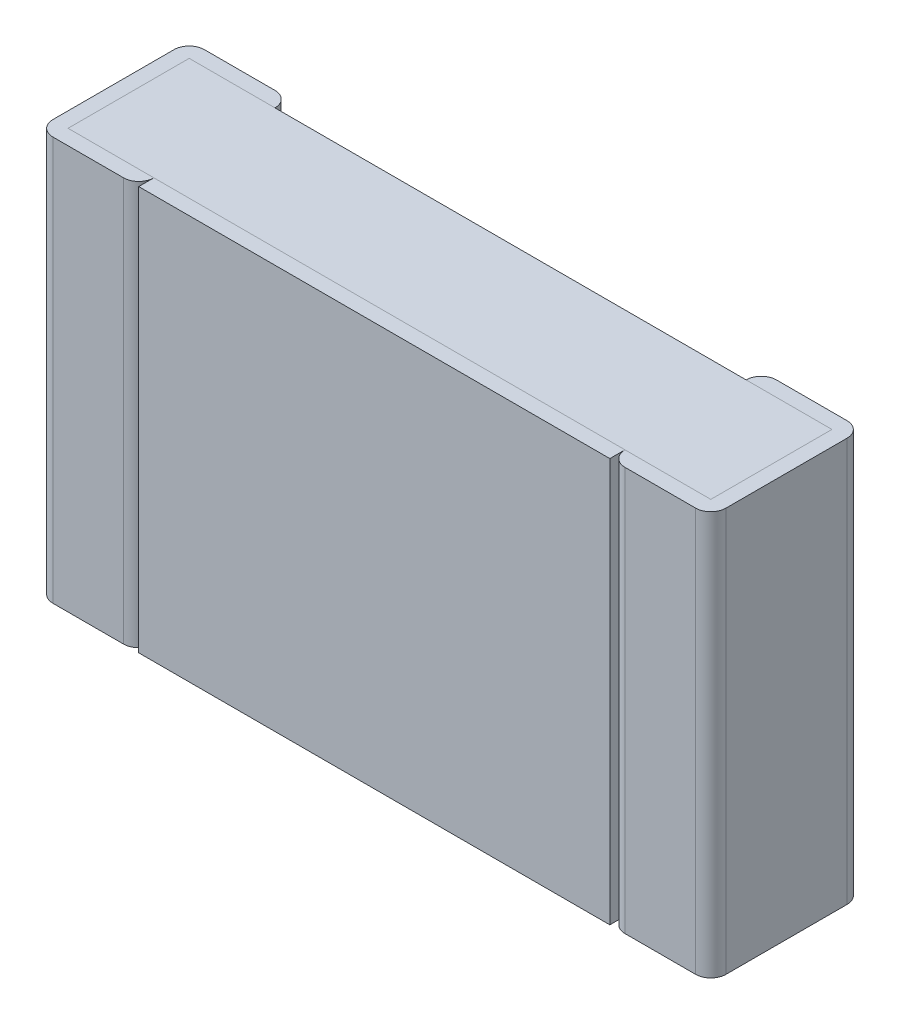
ISO-10303-21;
HEADER;
FILE_DESCRIPTION(('STEP AP214'),'2;1');
FILE_NAME('part.step','',(''),(''),'','','');
FILE_SCHEMA(('AUTOMOTIVE_DESIGN { 1 0 10303 214 1 1 1 1 }'));
ENDSEC;
DATA;
#1=APPLICATION_CONTEXT('core data for automotive mechanical design processes');
#2=APPLICATION_PROTOCOL_DEFINITION('international standard','automotive_design',2000,#1);
#3=PRODUCT_CONTEXT('',#1,'mechanical');
#4=PRODUCT('Part','Part','',(#3));
#5=PRODUCT_RELATED_PRODUCT_CATEGORY('part','',(#4));
#6=PRODUCT_DEFINITION_FORMATION('','',#4);
#7=PRODUCT_DEFINITION_CONTEXT('part definition',#1,'design');
#8=PRODUCT_DEFINITION('design','',#6,#7);
#9=PRODUCT_DEFINITION_SHAPE('','',#8);
#10=(LENGTH_UNIT() NAMED_UNIT(*) SI_UNIT(.MILLI.,.METRE.));
#11=(NAMED_UNIT(*) PLANE_ANGLE_UNIT() SI_UNIT($,.RADIAN.));
#12=(NAMED_UNIT(*) SI_UNIT($,.STERADIAN.) SOLID_ANGLE_UNIT());
#13=UNCERTAINTY_MEASURE_WITH_UNIT(LENGTH_MEASURE(1.E-05),#10,'distance_accuracy_value','');
#14=(GEOMETRIC_REPRESENTATION_CONTEXT(3) GLOBAL_UNCERTAINTY_ASSIGNED_CONTEXT((#13)) GLOBAL_UNIT_ASSIGNED_CONTEXT((#10,
#11,#12)) REPRESENTATION_CONTEXT('',''));
#15=CARTESIAN_POINT('',(0.,0.,0.));
#16=DIRECTION('',(0.,0.,1.));
#17=DIRECTION('',(1.,0.,0.));
#18=AXIS2_PLACEMENT_3D('',#15,#16,#17);
#19=CARTESIAN_POINT('',(-1.,-0.6,0.));
#20=DIRECTION('',(1.,0.,0.));
#21=DIRECTION('',(0.,1.,0.));
#22=AXIS2_PLACEMENT_3D('',#19,#20,#21);
#23=PLANE('',#22);
#24=DIRECTION('',(0.,1.,0.));
#25=VECTOR('',#24,1.);
#26=CARTESIAN_POINT('',(-1.,-0.6,0.405));
#27=LINE('',#26,#25);
#28=CARTESIAN_POINT('',(-1.,-0.6,0.405));
#29=VERTEX_POINT('',#28);
#30=CARTESIAN_POINT('',(-1.,0.6,0.405));
#31=VERTEX_POINT('',#30);
#32=EDGE_CURVE('E11',#29,#31,#27,.T.);
#33=ORIENTED_EDGE('',*,*,#32,.T.);
#34=DIRECTION('',(0.,0.,1.));
#35=VECTOR('',#34,1.);
#36=CARTESIAN_POINT('',(-1.,0.6,0.));
#37=LINE('',#36,#35);
#38=CARTESIAN_POINT('',(-1.,0.6,0.045));
#39=VERTEX_POINT('',#38);
#40=EDGE_CURVE('E40',#39,#31,#37,.T.);
#41=ORIENTED_EDGE('',*,*,#40,.F.);
#42=DIRECTION('',(0.,1.,0.));
#43=VECTOR('',#42,1.);
#44=CARTESIAN_POINT('',(-1.,-0.6,0.045));
#45=LINE('',#44,#43);
#46=CARTESIAN_POINT('',(-1.,-0.6,0.045));
#47=VERTEX_POINT('',#46);
#48=EDGE_CURVE('E298',#47,#39,#45,.T.);
#49=ORIENTED_EDGE('',*,*,#48,.F.);
#50=DIRECTION('',(0.,0.,1.));
#51=VECTOR('',#50,1.);
#52=CARTESIAN_POINT('',(-1.,-0.6,0.));
#53=LINE('',#52,#51);
#54=EDGE_CURVE('E26',#47,#29,#53,.T.);
#55=ORIENTED_EDGE('',*,*,#54,.T.);
#56=EDGE_LOOP('',(#33,#41,#49,#55));
#57=FACE_BOUND('',#56,.T.);
#58=ADVANCED_FACE('F16',(#57),#23,.F.);
#59=CARTESIAN_POINT('',(-1.,-0.6,0.));
#60=DIRECTION('',(0.,1.,0.));
#61=DIRECTION('',(1.,0.,0.));
#62=AXIS2_PLACEMENT_3D('',#59,#60,#61);
#63=PLANE('',#62);
#64=CARTESIAN_POINT('',(-0.745,-0.6,0.045));
#65=DIRECTION('',(0.,1.,0.));
#66=DIRECTION('',(0.,0.,1.));
#67=AXIS2_PLACEMENT_3D('',#64,#65,#66);
#68=CIRCLE('',#67,0.045);
#69=CARTESIAN_POINT('',(-0.7,-0.6,0.045));
#70=VERTEX_POINT('',#69);
#71=CARTESIAN_POINT('',(-0.745,-0.6,0.));
#72=VERTEX_POINT('',#71);
#73=EDGE_CURVE('E318',#70,#72,#68,.T.);
#74=ORIENTED_EDGE('',*,*,#73,.F.);
#75=DIRECTION('',(1.,0.,0.));
#76=VECTOR('',#75,1.);
#77=CARTESIAN_POINT('',(-0.955,-0.6,0.045));
#78=LINE('',#77,#76);
#79=CARTESIAN_POINT('',(-0.955,-0.6,0.045));
#80=VERTEX_POINT('',#79);
#81=EDGE_CURVE('E189',#80,#70,#78,.T.);
#82=ORIENTED_EDGE('',*,*,#81,.F.);
#83=DIRECTION('',(0.,0.,1.));
#84=VECTOR('',#83,1.);
#85=CARTESIAN_POINT('',(-0.955,-0.6,0.045));
#86=LINE('',#85,#84);
#87=CARTESIAN_POINT('',(-0.955,-0.6,0.405));
#88=VERTEX_POINT('',#87);
#89=EDGE_CURVE('E334',#80,#88,#86,.T.);
#90=ORIENTED_EDGE('',*,*,#89,.T.);
#91=DIRECTION('',(1.,0.,0.));
#92=VECTOR('',#91,1.);
#93=CARTESIAN_POINT('',(-0.955,-0.6,0.405));
#94=LINE('',#93,#92);
#95=CARTESIAN_POINT('',(-0.7,-0.6,0.405));
#96=VERTEX_POINT('',#95);
#97=EDGE_CURVE('E312',#88,#96,#94,.T.);
#98=ORIENTED_EDGE('',*,*,#97,.T.);
#99=CARTESIAN_POINT('',(-0.745,-0.6,0.405));
#100=DIRECTION('',(0.,-1.,0.));
#101=DIRECTION('',(0.,0.,1.));
#102=AXIS2_PLACEMENT_3D('',#99,#100,#101);
#103=CIRCLE('',#102,0.045);
#104=CARTESIAN_POINT('',(-0.745,-0.6,0.45));
#105=VERTEX_POINT('',#104);
#106=EDGE_CURVE('E183',#96,#105,#103,.T.);
#107=ORIENTED_EDGE('',*,*,#106,.T.);
#108=DIRECTION('',(1.,0.,0.));
#109=VECTOR('',#108,1.);
#110=CARTESIAN_POINT('',(-1.,-0.6,0.45));
#111=LINE('',#110,#109);
#112=CARTESIAN_POINT('',(-0.955,-0.6,0.45));
#113=VERTEX_POINT('',#112);
#114=EDGE_CURVE('E175',#113,#105,#111,.T.);
#115=ORIENTED_EDGE('',*,*,#114,.F.);
#116=CARTESIAN_POINT('',(-0.955,-0.6,0.405));
#117=DIRECTION('',(0.,1.,0.));
#118=DIRECTION('',(0.,0.,1.));
#119=AXIS2_PLACEMENT_3D('',#116,#117,#118);
#120=CIRCLE('',#119,0.045);
#121=EDGE_CURVE('E180',#29,#113,#120,.T.);
#122=ORIENTED_EDGE('',*,*,#121,.F.);
#123=ORIENTED_EDGE('',*,*,#54,.F.);
#124=CARTESIAN_POINT('',(-0.955,-0.6,0.045));
#125=DIRECTION('',(0.,-1.,0.));
#126=DIRECTION('',(0.,0.,1.));
#127=AXIS2_PLACEMENT_3D('',#124,#125,#126);
#128=CIRCLE('',#127,0.045);
#129=CARTESIAN_POINT('',(-0.955,-0.6,0.));
#130=VERTEX_POINT('',#129);
#131=EDGE_CURVE('E248',#47,#130,#128,.T.);
#132=ORIENTED_EDGE('',*,*,#131,.T.);
#133=DIRECTION('',(1.,0.,0.));
#134=VECTOR('',#133,1.);
#135=CARTESIAN_POINT('',(-1.,-0.6,0.));
#136=LINE('',#135,#134);
#137=EDGE_CURVE('E252',#130,#72,#136,.T.);
#138=ORIENTED_EDGE('',*,*,#137,.T.);
#139=EDGE_LOOP('',(#74,#82,#90,#98,#107,#115,#122,#123,#132,#138));
#140=FACE_BOUND('',#139,.T.);
#141=ADVANCED_FACE('F178',(#140),#63,.F.);
#142=CARTESIAN_POINT('',(-0.955,-0.6,0.045));
#143=DIRECTION('',(0.,1.,0.));
#144=DIRECTION('',(-1.,0.,0.));
#145=AXIS2_PLACEMENT_3D('',#142,#143,#144);
#146=CYLINDRICAL_SURFACE('',#145,0.045);
#147=ORIENTED_EDGE('',*,*,#48,.T.);
#148=CARTESIAN_POINT('',(-0.955,0.6,0.045));
#149=DIRECTION('',(0.,-1.,0.));
#150=DIRECTION('',(0.,0.,1.));
#151=AXIS2_PLACEMENT_3D('',#148,#149,#150);
#152=CIRCLE('',#151,0.045);
#153=CARTESIAN_POINT('',(-0.955,0.6,0.));
#154=VERTEX_POINT('',#153);
#155=EDGE_CURVE('E200',#39,#154,#152,.T.);
#156=ORIENTED_EDGE('',*,*,#155,.T.);
#157=DIRECTION('',(0.,1.,0.));
#158=VECTOR('',#157,1.);
#159=CARTESIAN_POINT('',(-0.955,-0.6,0.));
#160=LINE('',#159,#158);
#161=EDGE_CURVE('E302',#130,#154,#160,.T.);
#162=ORIENTED_EDGE('',*,*,#161,.F.);
#163=ORIENTED_EDGE('',*,*,#131,.F.);
#164=EDGE_LOOP('',(#147,#156,#162,#163));
#165=FACE_BOUND('',#164,.T.);
#166=ADVANCED_FACE('F470',(#165),#146,.T.);
#167=CARTESIAN_POINT('',(-0.955,-0.6,0.405));
#168=DIRECTION('',(0.,1.,0.));
#169=DIRECTION('',(-1.,0.,0.));
#170=AXIS2_PLACEMENT_3D('',#167,#168,#169);
#171=CYLINDRICAL_SURFACE('',#170,0.045);
#172=ORIENTED_EDGE('',*,*,#121,.T.);
#173=DIRECTION('',(0.,1.,0.));
#174=VECTOR('',#173,1.);
#175=CARTESIAN_POINT('',(-0.955,-0.6,0.45));
#176=LINE('',#175,#174);
#177=CARTESIAN_POINT('',(-0.955,0.6,0.45));
#178=VERTEX_POINT('',#177);
#179=EDGE_CURVE('E197',#113,#178,#176,.T.);
#180=ORIENTED_EDGE('',*,*,#179,.T.);
#181=CARTESIAN_POINT('',(-0.955,0.6,0.405));
#182=DIRECTION('',(0.,1.,0.));
#183=DIRECTION('',(0.,0.,1.));
#184=AXIS2_PLACEMENT_3D('',#181,#182,#183);
#185=CIRCLE('',#184,0.045);
#186=EDGE_CURVE('E211',#31,#178,#185,.T.);
#187=ORIENTED_EDGE('',*,*,#186,.F.);
#188=ORIENTED_EDGE('',*,*,#32,.F.);
#189=EDGE_LOOP('',(#172,#180,#187,#188));
#190=FACE_BOUND('',#189,.T.);
#191=ADVANCED_FACE('F195',(#190),#171,.T.);
#192=CARTESIAN_POINT('',(-1.,0.6,0.));
#193=DIRECTION('',(0.,1.,0.));
#194=DIRECTION('',(1.,0.,0.));
#195=AXIS2_PLACEMENT_3D('',#192,#193,#194);
#196=PLANE('',#195);
#197=DIRECTION('',(1.,0.,0.));
#198=VECTOR('',#197,1.);
#199=CARTESIAN_POINT('',(-1.,0.6,0.));
#200=LINE('',#199,#198);
#201=CARTESIAN_POINT('',(-0.745,0.6,0.));
#202=VERTEX_POINT('',#201);
#203=EDGE_CURVE('E306',#154,#202,#200,.T.);
#204=ORIENTED_EDGE('',*,*,#203,.F.);
#205=ORIENTED_EDGE('',*,*,#155,.F.);
#206=ORIENTED_EDGE('',*,*,#40,.T.);
#207=ORIENTED_EDGE('',*,*,#186,.T.);
#208=DIRECTION('',(1.,0.,0.));
#209=VECTOR('',#208,1.);
#210=CARTESIAN_POINT('',(-1.,0.6,0.45));
#211=LINE('',#210,#209);
#212=CARTESIAN_POINT('',(-0.745,0.6,0.45));
#213=VERTEX_POINT('',#212);
#214=EDGE_CURVE('E204',#178,#213,#211,.T.);
#215=ORIENTED_EDGE('',*,*,#214,.T.);
#216=CARTESIAN_POINT('',(-0.745,0.6,0.405));
#217=DIRECTION('',(0.,-1.,0.));
#218=DIRECTION('',(0.,0.,1.));
#219=AXIS2_PLACEMENT_3D('',#216,#217,#218);
#220=CIRCLE('',#219,0.045);
#221=CARTESIAN_POINT('',(-0.7,0.6,0.405));
#222=VERTEX_POINT('',#221);
#223=EDGE_CURVE('E256',#222,#213,#220,.T.);
#224=ORIENTED_EDGE('',*,*,#223,.F.);
#225=DIRECTION('',(1.,0.,0.));
#226=VECTOR('',#225,1.);
#227=CARTESIAN_POINT('',(-0.955,0.6,0.405));
#228=LINE('',#227,#226);
#229=CARTESIAN_POINT('',(-0.955,0.6,0.405));
#230=VERTEX_POINT('',#229);
#231=EDGE_CURVE('E217',#230,#222,#228,.T.);
#232=ORIENTED_EDGE('',*,*,#231,.F.);
#233=DIRECTION('',(0.,0.,1.));
#234=VECTOR('',#233,1.);
#235=CARTESIAN_POINT('',(-0.955,0.6,0.045));
#236=LINE('',#235,#234);
#237=CARTESIAN_POINT('',(-0.955,0.6,0.045));
#238=VERTEX_POINT('',#237);
#239=EDGE_CURVE('E220',#238,#230,#236,.T.);
#240=ORIENTED_EDGE('',*,*,#239,.F.);
#241=DIRECTION('',(1.,0.,0.));
#242=VECTOR('',#241,1.);
#243=CARTESIAN_POINT('',(-0.955,0.6,0.045));
#244=LINE('',#243,#242);
#245=CARTESIAN_POINT('',(-0.7,0.6,0.045));
#246=VERTEX_POINT('',#245);
#247=EDGE_CURVE('E276',#238,#246,#244,.T.);
#248=ORIENTED_EDGE('',*,*,#247,.T.);
#249=CARTESIAN_POINT('',(-0.745,0.6,0.045));
#250=DIRECTION('',(0.,1.,0.));
#251=DIRECTION('',(0.,0.,1.));
#252=AXIS2_PLACEMENT_3D('',#249,#250,#251);
#253=CIRCLE('',#252,0.045);
#254=EDGE_CURVE('E280',#246,#202,#253,.T.);
#255=ORIENTED_EDGE('',*,*,#254,.T.);
#256=EDGE_LOOP('',(#204,#205,#206,#207,#215,#224,#232,#240,#248,#255));
#257=FACE_BOUND('',#256,.T.);
#258=ADVANCED_FACE('F471',(#257),#196,.T.);
#259=CARTESIAN_POINT('',(-1.,-0.6,0.));
#260=DIRECTION('',(0.,0.,1.));
#261=DIRECTION('',(1.,0.,0.));
#262=AXIS2_PLACEMENT_3D('',#259,#260,#261);
#263=PLANE('',#262);
#264=DIRECTION('',(0.,1.,0.));
#265=VECTOR('',#264,1.);
#266=CARTESIAN_POINT('',(-0.745,-0.6,0.));
#267=LINE('',#266,#265);
#268=EDGE_CURVE('E285',#72,#202,#267,.T.);
#269=ORIENTED_EDGE('',*,*,#268,.F.);
#270=ORIENTED_EDGE('',*,*,#137,.F.);
#271=ORIENTED_EDGE('',*,*,#161,.T.);
#272=ORIENTED_EDGE('',*,*,#203,.T.);
#273=EDGE_LOOP('',(#269,#270,#271,#272));
#274=FACE_BOUND('',#273,.T.);
#275=ADVANCED_FACE('F466',(#274),#263,.F.);
#276=CARTESIAN_POINT('',(-0.745,-0.6,0.045));
#277=DIRECTION('',(0.,1.,0.));
#278=DIRECTION('',(1.,0.,0.));
#279=AXIS2_PLACEMENT_3D('',#276,#277,#278);
#280=CYLINDRICAL_SURFACE('',#279,0.045);
#281=ORIENTED_EDGE('',*,*,#73,.T.);
#282=ORIENTED_EDGE('',*,*,#268,.T.);
#283=ORIENTED_EDGE('',*,*,#254,.F.);
#284=DIRECTION('',(0.,1.,0.));
#285=VECTOR('',#284,1.);
#286=CARTESIAN_POINT('',(-0.7,-0.6,0.045));
#287=LINE('',#286,#285);
#288=EDGE_CURVE('E241',#70,#246,#287,.T.);
#289=ORIENTED_EDGE('',*,*,#288,.F.);
#290=EDGE_LOOP('',(#281,#282,#283,#289));
#291=FACE_BOUND('',#290,.T.);
#292=ADVANCED_FACE('F478',(#291),#280,.T.);
#293=CARTESIAN_POINT('',(-0.955,-0.6,0.045));
#294=DIRECTION('',(0.,1.,0.));
#295=DIRECTION('',(1.,0.,0.));
#296=AXIS2_PLACEMENT_3D('',#293,#294,#295);
#297=PLANE('',#296);
#298=DIRECTION('',(1.,0.,0.));
#299=VECTOR('',#298,1.);
#300=CARTESIAN_POINT('',(-0.955,-0.6,0.045));
#301=LINE('',#300,#299);
#302=CARTESIAN_POINT('',(0.7,-0.6,0.045));
#303=VERTEX_POINT('',#302);
#304=EDGE_CURVE('E281',#70,#303,#301,.T.);
#305=ORIENTED_EDGE('',*,*,#304,.T.);
#306=DIRECTION('',(1.,0.,0.));
#307=VECTOR('',#306,1.);
#308=CARTESIAN_POINT('',(-0.955,-0.6,0.045));
#309=LINE('',#308,#307);
#310=CARTESIAN_POINT('',(0.955,-0.6,0.045));
#311=VERTEX_POINT('',#310);
#312=EDGE_CURVE('E286',#303,#311,#309,.T.);
#313=ORIENTED_EDGE('',*,*,#312,.T.);
#314=DIRECTION('',(0.,0.,1.));
#315=VECTOR('',#314,1.);
#316=CARTESIAN_POINT('',(0.955,-0.6,0.045));
#317=LINE('',#316,#315);
#318=CARTESIAN_POINT('',(0.955,-0.6,0.405));
#319=VERTEX_POINT('',#318);
#320=EDGE_CURVE('E322',#311,#319,#317,.T.);
#321=ORIENTED_EDGE('',*,*,#320,.T.);
#322=DIRECTION('',(1.,0.,0.));
#323=VECTOR('',#322,1.);
#324=CARTESIAN_POINT('',(-0.955,-0.6,0.405));
#325=LINE('',#324,#323);
#326=CARTESIAN_POINT('',(0.7,-0.6,0.405));
#327=VERTEX_POINT('',#326);
#328=EDGE_CURVE('E331',#327,#319,#325,.T.);
#329=ORIENTED_EDGE('',*,*,#328,.F.);
#330=DIRECTION('',(1.,0.,0.));
#331=VECTOR('',#330,1.);
#332=CARTESIAN_POINT('',(-0.7,-0.6,0.405));
#333=LINE('',#332,#331);
#334=EDGE_CURVE('E259',#96,#327,#333,.T.);
#335=ORIENTED_EDGE('',*,*,#334,.F.);
#336=ORIENTED_EDGE('',*,*,#97,.F.);
#337=ORIENTED_EDGE('',*,*,#89,.F.);
#338=ORIENTED_EDGE('',*,*,#81,.T.);
#339=EDGE_LOOP('',(#305,#313,#321,#329,#335,#336,#337,#338));
#340=FACE_BOUND('',#339,.T.);
#341=ADVANCED_FACE('F515',(#340),#297,.F.);
#342=CARTESIAN_POINT('',(-1.,-0.6,0.45));
#343=DIRECTION('',(0.,0.,1.));
#344=DIRECTION('',(1.,0.,0.));
#345=AXIS2_PLACEMENT_3D('',#342,#343,#344);
#346=PLANE('',#345);
#347=ORIENTED_EDGE('',*,*,#214,.F.);
#348=ORIENTED_EDGE('',*,*,#179,.F.);
#349=ORIENTED_EDGE('',*,*,#114,.T.);
#350=DIRECTION('',(0.,1.,0.));
#351=VECTOR('',#350,1.);
#352=CARTESIAN_POINT('',(-0.745,-0.6,0.45));
#353=LINE('',#352,#351);
#354=EDGE_CURVE('E190',#105,#213,#353,.T.);
#355=ORIENTED_EDGE('',*,*,#354,.T.);
#356=EDGE_LOOP('',(#347,#348,#349,#355));
#357=FACE_BOUND('',#356,.T.);
#358=ADVANCED_FACE('F202',(#357),#346,.T.);
#359=CARTESIAN_POINT('',(-0.745,-0.6,0.405));
#360=DIRECTION('',(0.,1.,0.));
#361=DIRECTION('',(1.,0.,0.));
#362=AXIS2_PLACEMENT_3D('',#359,#360,#361);
#363=CYLINDRICAL_SURFACE('',#362,0.045);
#364=DIRECTION('',(0.,1.,0.));
#365=VECTOR('',#364,1.);
#366=CARTESIAN_POINT('',(-0.7,-0.6,0.405));
#367=LINE('',#366,#365);
#368=EDGE_CURVE('E19',#96,#222,#367,.T.);
#369=ORIENTED_EDGE('',*,*,#368,.T.);
#370=ORIENTED_EDGE('',*,*,#223,.T.);
#371=ORIENTED_EDGE('',*,*,#354,.F.);
#372=ORIENTED_EDGE('',*,*,#106,.F.);
#373=EDGE_LOOP('',(#369,#370,#371,#372));
#374=FACE_BOUND('',#373,.T.);
#375=ADVANCED_FACE('F486',(#374),#363,.T.);
#376=CARTESIAN_POINT('',(-0.955,0.6,0.045));
#377=DIRECTION('',(0.,1.,0.));
#378=DIRECTION('',(1.,0.,0.));
#379=AXIS2_PLACEMENT_3D('',#376,#377,#378);
#380=PLANE('',#379);
#381=ORIENTED_EDGE('',*,*,#247,.F.);
#382=ORIENTED_EDGE('',*,*,#239,.T.);
#383=ORIENTED_EDGE('',*,*,#231,.T.);
#384=DIRECTION('',(1.,0.,0.));
#385=VECTOR('',#384,1.);
#386=CARTESIAN_POINT('',(-0.7,0.6,0.405));
#387=LINE('',#386,#385);
#388=CARTESIAN_POINT('',(0.7,0.6,0.405));
#389=VERTEX_POINT('',#388);
#390=EDGE_CURVE('E221',#222,#389,#387,.T.);
#391=ORIENTED_EDGE('',*,*,#390,.T.);
#392=DIRECTION('',(1.,0.,0.));
#393=VECTOR('',#392,1.);
#394=CARTESIAN_POINT('',(-0.955,0.6,0.405));
#395=LINE('',#394,#393);
#396=CARTESIAN_POINT('',(0.955,0.6,0.405));
#397=VERTEX_POINT('',#396);
#398=EDGE_CURVE('E222',#389,#397,#395,.T.);
#399=ORIENTED_EDGE('',*,*,#398,.T.);
#400=DIRECTION('',(0.,0.,1.));
#401=VECTOR('',#400,1.);
#402=CARTESIAN_POINT('',(0.955,0.6,0.045));
#403=LINE('',#402,#401);
#404=CARTESIAN_POINT('',(0.955,0.6,0.045));
#405=VERTEX_POINT('',#404);
#406=EDGE_CURVE('E291',#405,#397,#403,.T.);
#407=ORIENTED_EDGE('',*,*,#406,.F.);
#408=DIRECTION('',(1.,0.,0.));
#409=VECTOR('',#408,1.);
#410=CARTESIAN_POINT('',(-0.955,0.6,0.045));
#411=LINE('',#410,#409);
#412=CARTESIAN_POINT('',(0.7,0.6,0.045));
#413=VERTEX_POINT('',#412);
#414=EDGE_CURVE('E287',#413,#405,#411,.T.);
#415=ORIENTED_EDGE('',*,*,#414,.F.);
#416=DIRECTION('',(1.,0.,0.));
#417=VECTOR('',#416,1.);
#418=CARTESIAN_POINT('',(-0.955,0.6,0.045));
#419=LINE('',#418,#417);
#420=EDGE_CURVE('E225',#246,#413,#419,.T.);
#421=ORIENTED_EDGE('',*,*,#420,.F.);
#422=EDGE_LOOP('',(#381,#382,#383,#391,#399,#407,#415,#421));
#423=FACE_BOUND('',#422,.T.);
#424=ADVANCED_FACE('F501',(#423),#380,.T.);
#425=CARTESIAN_POINT('',(-0.955,-0.6,0.045));
#426=DIRECTION('',(0.,0.,1.));
#427=DIRECTION('',(1.,0.,0.));
#428=AXIS2_PLACEMENT_3D('',#425,#426,#427);
#429=PLANE('',#428);
#430=ORIENTED_EDGE('',*,*,#420,.T.);
#431=DIRECTION('',(0.,1.,0.));
#432=VECTOR('',#431,1.);
#433=CARTESIAN_POINT('',(0.7,-0.6,0.045));
#434=LINE('',#433,#432);
#435=EDGE_CURVE('E375',#303,#413,#434,.T.);
#436=ORIENTED_EDGE('',*,*,#435,.F.);
#437=ORIENTED_EDGE('',*,*,#304,.F.);
#438=ORIENTED_EDGE('',*,*,#288,.T.);
#439=EDGE_LOOP('',(#430,#436,#437,#438));
#440=FACE_BOUND('',#439,.T.);
#441=ADVANCED_FACE('F568',(#440),#429,.F.);
#442=CARTESIAN_POINT('',(0.7,-0.6,0.));
#443=DIRECTION('',(0.,1.,0.));
#444=DIRECTION('',(1.,0.,0.));
#445=AXIS2_PLACEMENT_3D('',#442,#443,#444);
#446=PLANE('',#445);
#447=CARTESIAN_POINT('',(0.955,-0.6,0.045));
#448=DIRECTION('',(0.,1.,0.));
#449=DIRECTION('',(0.,0.,1.));
#450=AXIS2_PLACEMENT_3D('',#447,#448,#449);
#451=CIRCLE('',#450,0.045);
#452=CARTESIAN_POINT('',(1.,-0.6,0.045));
#453=VERTEX_POINT('',#452);
#454=CARTESIAN_POINT('',(0.955,-0.6,0.));
#455=VERTEX_POINT('',#454);
#456=EDGE_CURVE('E346',#453,#455,#451,.T.);
#457=ORIENTED_EDGE('',*,*,#456,.F.);
#458=DIRECTION('',(0.,0.,1.));
#459=VECTOR('',#458,1.);
#460=CARTESIAN_POINT('',(1.,-0.6,0.));
#461=LINE('',#460,#459);
#462=CARTESIAN_POINT('',(1.,-0.6,0.405));
#463=VERTEX_POINT('',#462);
#464=EDGE_CURVE('E330',#453,#463,#461,.T.);
#465=ORIENTED_EDGE('',*,*,#464,.T.);
#466=CARTESIAN_POINT('',(0.955,-0.6,0.405));
#467=DIRECTION('',(0.,-1.,0.));
#468=DIRECTION('',(0.,0.,1.));
#469=AXIS2_PLACEMENT_3D('',#466,#467,#468);
#470=CIRCLE('',#469,0.045);
#471=CARTESIAN_POINT('',(0.955,-0.6,0.45));
#472=VERTEX_POINT('',#471);
#473=EDGE_CURVE('E326',#463,#472,#470,.T.);
#474=ORIENTED_EDGE('',*,*,#473,.T.);
#475=DIRECTION('',(1.,0.,0.));
#476=VECTOR('',#475,1.);
#477=CARTESIAN_POINT('',(0.7,-0.6,0.45));
#478=LINE('',#477,#476);
#479=CARTESIAN_POINT('',(0.745,-0.6,0.45));
#480=VERTEX_POINT('',#479);
#481=EDGE_CURVE('E246',#480,#472,#478,.T.);
#482=ORIENTED_EDGE('',*,*,#481,.F.);
#483=CARTESIAN_POINT('',(0.745,-0.6,0.405));
#484=DIRECTION('',(0.,1.,0.));
#485=DIRECTION('',(0.,0.,1.));
#486=AXIS2_PLACEMENT_3D('',#483,#484,#485);
#487=CIRCLE('',#486,0.045);
#488=EDGE_CURVE('E247',#327,#480,#487,.T.);
#489=ORIENTED_EDGE('',*,*,#488,.F.);
#490=ORIENTED_EDGE('',*,*,#328,.T.);
#491=ORIENTED_EDGE('',*,*,#320,.F.);
#492=ORIENTED_EDGE('',*,*,#312,.F.);
#493=CARTESIAN_POINT('',(0.745,-0.6,0.045));
#494=DIRECTION('',(0.,-1.,0.));
#495=DIRECTION('',(0.,0.,1.));
#496=AXIS2_PLACEMENT_3D('',#493,#494,#495);
#497=CIRCLE('',#496,0.045);
#498=CARTESIAN_POINT('',(0.745,-0.6,0.));
#499=VERTEX_POINT('',#498);
#500=EDGE_CURVE('E269',#303,#499,#497,.T.);
#501=ORIENTED_EDGE('',*,*,#500,.T.);
#502=DIRECTION('',(1.,0.,0.));
#503=VECTOR('',#502,1.);
#504=CARTESIAN_POINT('',(0.7,-0.6,0.));
#505=LINE('',#504,#503);
#506=EDGE_CURVE('E265',#499,#455,#505,.T.);
#507=ORIENTED_EDGE('',*,*,#506,.T.);
#508=EDGE_LOOP('',(#457,#465,#474,#482,#489,#490,#491,#492,#501,#507));
#509=FACE_BOUND('',#508,.T.);
#510=ADVANCED_FACE('F519',(#509),#446,.F.);
#511=CARTESIAN_POINT('',(-0.7,-0.6,0.405));
#512=DIRECTION('',(0.,1.,0.));
#513=DIRECTION('',(1.,0.,0.));
#514=AXIS2_PLACEMENT_3D('',#511,#512,#513);
#515=PLANE('',#514);
#516=DIRECTION('',(0.,0.,1.));
#517=VECTOR('',#516,1.);
#518=CARTESIAN_POINT('',(0.7,-0.6,0.405));
#519=LINE('',#518,#517);
#520=CARTESIAN_POINT('',(0.7,-0.6,0.45));
#521=VERTEX_POINT('',#520);
#522=EDGE_CURVE('E263',#327,#521,#519,.T.);
#523=ORIENTED_EDGE('',*,*,#522,.T.);
#524=DIRECTION('',(1.,0.,0.));
#525=VECTOR('',#524,1.);
#526=CARTESIAN_POINT('',(-0.7,-0.6,0.45));
#527=LINE('',#526,#525);
#528=CARTESIAN_POINT('',(-0.7,-0.6,0.45));
#529=VERTEX_POINT('',#528);
#530=EDGE_CURVE('E354',#529,#521,#527,.T.);
#531=ORIENTED_EDGE('',*,*,#530,.F.);
#532=DIRECTION('',(0.,0.,1.));
#533=VECTOR('',#532,1.);
#534=CARTESIAN_POINT('',(-0.7,-0.6,0.405));
#535=LINE('',#534,#533);
#536=EDGE_CURVE('E215',#96,#529,#535,.T.);
#537=ORIENTED_EDGE('',*,*,#536,.F.);
#538=ORIENTED_EDGE('',*,*,#334,.T.);
#539=EDGE_LOOP('',(#523,#531,#537,#538));
#540=FACE_BOUND('',#539,.T.);
#541=ADVANCED_FACE('F523',(#540),#515,.F.);
#542=CARTESIAN_POINT('',(-0.7,-0.6,0.405));
#543=DIRECTION('',(1.,0.,0.));
#544=DIRECTION('',(0.,1.,0.));
#545=AXIS2_PLACEMENT_3D('',#542,#543,#544);
#546=PLANE('',#545);
#547=DIRECTION('',(0.,1.,0.));
#548=VECTOR('',#547,1.);
#549=CARTESIAN_POINT('',(-0.7,-0.6,0.45));
#550=LINE('',#549,#548);
#551=CARTESIAN_POINT('',(-0.7,0.6,0.45));
#552=VERTEX_POINT('',#551);
#553=EDGE_CURVE('E264',#529,#552,#550,.T.);
#554=ORIENTED_EDGE('',*,*,#553,.T.);
#555=DIRECTION('',(0.,0.,1.));
#556=VECTOR('',#555,1.);
#557=CARTESIAN_POINT('',(-0.7,0.6,0.405));
#558=LINE('',#557,#556);
#559=EDGE_CURVE('E231',#222,#552,#558,.T.);
#560=ORIENTED_EDGE('',*,*,#559,.F.);
#561=ORIENTED_EDGE('',*,*,#368,.F.);
#562=ORIENTED_EDGE('',*,*,#536,.T.);
#563=EDGE_LOOP('',(#554,#560,#561,#562));
#564=FACE_BOUND('',#563,.T.);
#565=ADVANCED_FACE('F494',(#564),#546,.F.);
#566=CARTESIAN_POINT('',(0.7,0.6,0.));
#567=DIRECTION('',(0.,1.,0.));
#568=DIRECTION('',(1.,0.,0.));
#569=AXIS2_PLACEMENT_3D('',#566,#567,#568);
#570=PLANE('',#569);
#571=DIRECTION('',(1.,0.,0.));
#572=VECTOR('',#571,1.);
#573=CARTESIAN_POINT('',(0.7,0.6,0.));
#574=LINE('',#573,#572);
#575=CARTESIAN_POINT('',(0.745,0.6,0.));
#576=VERTEX_POINT('',#575);
#577=CARTESIAN_POINT('',(0.955,0.6,0.));
#578=VERTEX_POINT('',#577);
#579=EDGE_CURVE('E274',#576,#578,#574,.T.);
#580=ORIENTED_EDGE('',*,*,#579,.F.);
#581=CARTESIAN_POINT('',(0.745,0.6,0.045));
#582=DIRECTION('',(0.,-1.,0.));
#583=DIRECTION('',(0.,0.,1.));
#584=AXIS2_PLACEMENT_3D('',#581,#582,#583);
#585=CIRCLE('',#584,0.045);
#586=EDGE_CURVE('E273',#413,#576,#585,.T.);
#587=ORIENTED_EDGE('',*,*,#586,.F.);
#588=ORIENTED_EDGE('',*,*,#414,.T.);
#589=ORIENTED_EDGE('',*,*,#406,.T.);
#590=ORIENTED_EDGE('',*,*,#398,.F.);
#591=CARTESIAN_POINT('',(0.745,0.6,0.405));
#592=DIRECTION('',(0.,1.,0.));
#593=DIRECTION('',(0.,0.,1.));
#594=AXIS2_PLACEMENT_3D('',#591,#592,#593);
#595=CIRCLE('',#594,0.045);
#596=CARTESIAN_POINT('',(0.745,0.6,0.45));
#597=VERTEX_POINT('',#596);
#598=EDGE_CURVE('E338',#389,#597,#595,.T.);
#599=ORIENTED_EDGE('',*,*,#598,.T.);
#600=DIRECTION('',(1.,0.,0.));
#601=VECTOR('',#600,1.);
#602=CARTESIAN_POINT('',(0.7,0.6,0.45));
#603=LINE('',#602,#601);
#604=CARTESIAN_POINT('',(0.955,0.6,0.45));
#605=VERTEX_POINT('',#604);
#606=EDGE_CURVE('E230',#597,#605,#603,.T.);
#607=ORIENTED_EDGE('',*,*,#606,.T.);
#608=CARTESIAN_POINT('',(0.955,0.6,0.405));
#609=DIRECTION('',(0.,-1.,0.));
#610=DIRECTION('',(0.,0.,1.));
#611=AXIS2_PLACEMENT_3D('',#608,#609,#610);
#612=CIRCLE('',#611,0.045);
#613=CARTESIAN_POINT('',(1.,0.6,0.405));
#614=VERTEX_POINT('',#613);
#615=EDGE_CURVE('E237',#614,#605,#612,.T.);
#616=ORIENTED_EDGE('',*,*,#615,.F.);
#617=DIRECTION('',(0.,0.,1.));
#618=VECTOR('',#617,1.);
#619=CARTESIAN_POINT('',(1.,0.6,0.));
#620=LINE('',#619,#618);
#621=CARTESIAN_POINT('',(1.,0.6,0.045));
#622=VERTEX_POINT('',#621);
#623=EDGE_CURVE('E236',#622,#614,#620,.T.);
#624=ORIENTED_EDGE('',*,*,#623,.F.);
#625=CARTESIAN_POINT('',(0.955,0.6,0.045));
#626=DIRECTION('',(0.,1.,0.));
#627=DIRECTION('',(0.,0.,1.));
#628=AXIS2_PLACEMENT_3D('',#625,#626,#627);
#629=CIRCLE('',#628,0.045);
#630=EDGE_CURVE('E226',#622,#578,#629,.T.);
#631=ORIENTED_EDGE('',*,*,#630,.T.);
#632=EDGE_LOOP('',(#580,#587,#588,#589,#590,#599,#607,#616,#624,#631));
#633=FACE_BOUND('',#632,.T.);
#634=ADVANCED_FACE('F445',(#633),#570,.T.);
#635=CARTESIAN_POINT('',(-0.7,0.6,0.405));
#636=DIRECTION('',(0.,1.,0.));
#637=DIRECTION('',(1.,0.,0.));
#638=AXIS2_PLACEMENT_3D('',#635,#636,#637);
#639=PLANE('',#638);
#640=ORIENTED_EDGE('',*,*,#390,.F.);
#641=ORIENTED_EDGE('',*,*,#559,.T.);
#642=DIRECTION('',(1.,0.,0.));
#643=VECTOR('',#642,1.);
#644=CARTESIAN_POINT('',(-0.7,0.6,0.45));
#645=LINE('',#644,#643);
#646=CARTESIAN_POINT('',(0.7,0.6,0.45));
#647=VERTEX_POINT('',#646);
#648=EDGE_CURVE('E255',#552,#647,#645,.T.);
#649=ORIENTED_EDGE('',*,*,#648,.T.);
#650=DIRECTION('',(0.,0.,1.));
#651=VECTOR('',#650,1.);
#652=CARTESIAN_POINT('',(0.7,0.6,0.405));
#653=LINE('',#652,#651);
#654=EDGE_CURVE('E296',#389,#647,#653,.T.);
#655=ORIENTED_EDGE('',*,*,#654,.F.);
#656=EDGE_LOOP('',(#640,#641,#649,#655));
#657=FACE_BOUND('',#656,.T.);
#658=ADVANCED_FACE('F498',(#657),#639,.T.);
#659=CARTESIAN_POINT('',(0.745,-0.6,0.045));
#660=DIRECTION('',(0.,1.,0.));
#661=DIRECTION('',(-1.,0.,0.));
#662=AXIS2_PLACEMENT_3D('',#659,#660,#661);
#663=CYLINDRICAL_SURFACE('',#662,0.045);
#664=ORIENTED_EDGE('',*,*,#435,.T.);
#665=ORIENTED_EDGE('',*,*,#586,.T.);
#666=DIRECTION('',(0.,1.,0.));
#667=VECTOR('',#666,1.);
#668=CARTESIAN_POINT('',(0.745,-0.6,0.));
#669=LINE('',#668,#667);
#670=EDGE_CURVE('E270',#499,#576,#669,.T.);
#671=ORIENTED_EDGE('',*,*,#670,.F.);
#672=ORIENTED_EDGE('',*,*,#500,.F.);
#673=EDGE_LOOP('',(#664,#665,#671,#672));
#674=FACE_BOUND('',#673,.T.);
#675=ADVANCED_FACE('F600',(#674),#663,.T.);
#676=CARTESIAN_POINT('',(0.7,-0.6,0.));
#677=DIRECTION('',(0.,0.,1.));
#678=DIRECTION('',(1.,0.,0.));
#679=AXIS2_PLACEMENT_3D('',#676,#677,#678);
#680=PLANE('',#679);
#681=DIRECTION('',(0.,1.,0.));
#682=VECTOR('',#681,1.);
#683=CARTESIAN_POINT('',(0.955,-0.6,0.));
#684=LINE('',#683,#682);
#685=EDGE_CURVE('E349',#455,#578,#684,.T.);
#686=ORIENTED_EDGE('',*,*,#685,.F.);
#687=ORIENTED_EDGE('',*,*,#506,.F.);
#688=ORIENTED_EDGE('',*,*,#670,.T.);
#689=ORIENTED_EDGE('',*,*,#579,.T.);
#690=EDGE_LOOP('',(#686,#687,#688,#689));
#691=FACE_BOUND('',#690,.T.);
#692=ADVANCED_FACE('F596',(#691),#680,.F.);
#693=CARTESIAN_POINT('',(0.955,-0.6,0.045));
#694=DIRECTION('',(0.,1.,0.));
#695=DIRECTION('',(1.,0.,0.));
#696=AXIS2_PLACEMENT_3D('',#693,#694,#695);
#697=CYLINDRICAL_SURFACE('',#696,0.045);
#698=ORIENTED_EDGE('',*,*,#456,.T.);
#699=ORIENTED_EDGE('',*,*,#685,.T.);
#700=ORIENTED_EDGE('',*,*,#630,.F.);
#701=DIRECTION('',(0.,1.,0.));
#702=VECTOR('',#701,1.);
#703=CARTESIAN_POINT('',(1.,-0.6,0.045));
#704=LINE('',#703,#702);
#705=EDGE_CURVE('E342',#453,#622,#704,.T.);
#706=ORIENTED_EDGE('',*,*,#705,.F.);
#707=EDGE_LOOP('',(#698,#699,#700,#706));
#708=FACE_BOUND('',#707,.T.);
#709=ADVANCED_FACE('F599',(#708),#697,.T.);
#710=CARTESIAN_POINT('',(1.,-0.6,0.));
#711=DIRECTION('',(1.,0.,0.));
#712=DIRECTION('',(0.,1.,0.));
#713=AXIS2_PLACEMENT_3D('',#710,#711,#712);
#714=PLANE('',#713);
#715=ORIENTED_EDGE('',*,*,#464,.F.);
#716=ORIENTED_EDGE('',*,*,#705,.T.);
#717=ORIENTED_EDGE('',*,*,#623,.T.);
#718=DIRECTION('',(0.,1.,0.));
#719=VECTOR('',#718,1.);
#720=CARTESIAN_POINT('',(1.,-0.6,0.405));
#721=LINE('',#720,#719);
#722=EDGE_CURVE('E232',#463,#614,#721,.T.);
#723=ORIENTED_EDGE('',*,*,#722,.F.);
#724=EDGE_LOOP('',(#715,#716,#717,#723));
#725=FACE_BOUND('',#724,.T.);
#726=ADVANCED_FACE('F581',(#725),#714,.T.);
#727=CARTESIAN_POINT('',(0.955,-0.6,0.405));
#728=DIRECTION('',(0.,1.,0.));
#729=DIRECTION('',(1.,0.,0.));
#730=AXIS2_PLACEMENT_3D('',#727,#728,#729);
#731=CYLINDRICAL_SURFACE('',#730,0.045);
#732=ORIENTED_EDGE('',*,*,#722,.T.);
#733=ORIENTED_EDGE('',*,*,#615,.T.);
#734=DIRECTION('',(0.,1.,0.));
#735=VECTOR('',#734,1.);
#736=CARTESIAN_POINT('',(0.955,-0.6,0.45));
#737=LINE('',#736,#735);
#738=EDGE_CURVE('E242',#472,#605,#737,.T.);
#739=ORIENTED_EDGE('',*,*,#738,.F.);
#740=ORIENTED_EDGE('',*,*,#473,.F.);
#741=EDGE_LOOP('',(#732,#733,#739,#740));
#742=FACE_BOUND('',#741,.T.);
#743=ADVANCED_FACE('F579',(#742),#731,.T.);
#744=CARTESIAN_POINT('',(0.7,-0.6,0.45));
#745=DIRECTION('',(0.,0.,1.));
#746=DIRECTION('',(1.,0.,0.));
#747=AXIS2_PLACEMENT_3D('',#744,#745,#746);
#748=PLANE('',#747);
#749=ORIENTED_EDGE('',*,*,#606,.F.);
#750=DIRECTION('',(0.,1.,0.));
#751=VECTOR('',#750,1.);
#752=CARTESIAN_POINT('',(0.745,-0.6,0.45));
#753=LINE('',#752,#751);
#754=EDGE_CURVE('E295',#480,#597,#753,.T.);
#755=ORIENTED_EDGE('',*,*,#754,.F.);
#756=ORIENTED_EDGE('',*,*,#481,.T.);
#757=ORIENTED_EDGE('',*,*,#738,.T.);
#758=EDGE_LOOP('',(#749,#755,#756,#757));
#759=FACE_BOUND('',#758,.T.);
#760=ADVANCED_FACE('F452',(#759),#748,.T.);
#761=CARTESIAN_POINT('',(0.745,-0.6,0.405));
#762=DIRECTION('',(0.,1.,0.));
#763=DIRECTION('',(-1.,0.,0.));
#764=AXIS2_PLACEMENT_3D('',#761,#762,#763);
#765=CYLINDRICAL_SURFACE('',#764,0.045);
#766=ORIENTED_EDGE('',*,*,#488,.T.);
#767=ORIENTED_EDGE('',*,*,#754,.T.);
#768=ORIENTED_EDGE('',*,*,#598,.F.);
#769=DIRECTION('',(0.,1.,0.));
#770=VECTOR('',#769,1.);
#771=CARTESIAN_POINT('',(0.7,-0.6,0.405));
#772=LINE('',#771,#770);
#773=EDGE_CURVE('E292',#327,#389,#772,.T.);
#774=ORIENTED_EDGE('',*,*,#773,.F.);
#775=EDGE_LOOP('',(#766,#767,#768,#774));
#776=FACE_BOUND('',#775,.T.);
#777=ADVANCED_FACE('F449',(#776),#765,.T.);
#778=CARTESIAN_POINT('',(0.7,-0.6,0.405));
#779=DIRECTION('',(1.,0.,0.));
#780=DIRECTION('',(0.,1.,0.));
#781=AXIS2_PLACEMENT_3D('',#778,#779,#780);
#782=PLANE('',#781);
#783=ORIENTED_EDGE('',*,*,#522,.F.);
#784=ORIENTED_EDGE('',*,*,#773,.T.);
#785=ORIENTED_EDGE('',*,*,#654,.T.);
#786=DIRECTION('',(0.,1.,0.));
#787=VECTOR('',#786,1.);
#788=CARTESIAN_POINT('',(0.7,-0.6,0.45));
#789=LINE('',#788,#787);
#790=EDGE_CURVE('E384',#521,#647,#789,.T.);
#791=ORIENTED_EDGE('',*,*,#790,.F.);
#792=EDGE_LOOP('',(#783,#784,#785,#791));
#793=FACE_BOUND('',#792,.T.);
#794=ADVANCED_FACE('F528',(#793),#782,.T.);
#795=CARTESIAN_POINT('',(-0.7,-0.6,0.45));
#796=DIRECTION('',(0.,0.,1.));
#797=DIRECTION('',(1.,0.,0.));
#798=AXIS2_PLACEMENT_3D('',#795,#796,#797);
#799=PLANE('',#798);
#800=ORIENTED_EDGE('',*,*,#553,.F.);
#801=ORIENTED_EDGE('',*,*,#530,.T.);
#802=ORIENTED_EDGE('',*,*,#790,.T.);
#803=ORIENTED_EDGE('',*,*,#648,.F.);
#804=EDGE_LOOP('',(#800,#801,#802,#803));
#805=FACE_BOUND('',#804,.T.);
#806=ADVANCED_FACE('F530',(#805),#799,.T.);
#807=CLOSED_SHELL('',(#58,#141,#166,#191,#258,#275,#292,#341,#358,#375,#424,#441,#510,#541,#565,
#634,#658,#675,#692,#709,#726,#743,#760,#777,#794,#806));
#808=MANIFOLD_SOLID_BREP('B1',#807);
#809=ADVANCED_BREP_SHAPE_REPRESENTATION('',(#18,#808),#14);
#810=SHAPE_DEFINITION_REPRESENTATION(#9,#809);
ENDSEC;
END-ISO-10303-21;
